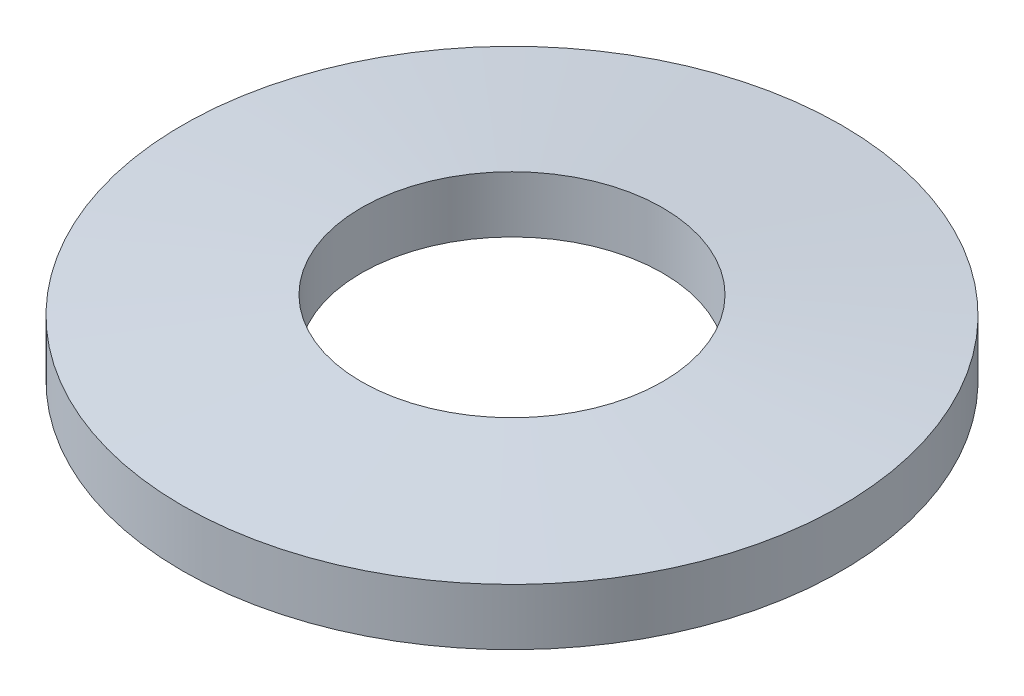
ISO-10303-21;
HEADER;
FILE_DESCRIPTION(('STEP AP214'),'2;1');
FILE_NAME('part.step','',(''),(''),'','','');
FILE_SCHEMA(('AUTOMOTIVE_DESIGN { 1 0 10303 214 1 1 1 1 }'));
ENDSEC;
DATA;
#1=APPLICATION_CONTEXT('core data for automotive mechanical design processes');
#2=APPLICATION_PROTOCOL_DEFINITION('international standard','automotive_design',2000,#1);
#3=PRODUCT_CONTEXT('',#1,'mechanical');
#4=PRODUCT('Part','Part','',(#3));
#5=PRODUCT_RELATED_PRODUCT_CATEGORY('part','',(#4));
#6=PRODUCT_DEFINITION_FORMATION('','',#4);
#7=PRODUCT_DEFINITION_CONTEXT('part definition',#1,'design');
#8=PRODUCT_DEFINITION('design','',#6,#7);
#9=PRODUCT_DEFINITION_SHAPE('','',#8);
#10=(LENGTH_UNIT() NAMED_UNIT(*) SI_UNIT(.MILLI.,.METRE.));
#11=(NAMED_UNIT(*) PLANE_ANGLE_UNIT() SI_UNIT($,.RADIAN.));
#12=(NAMED_UNIT(*) SI_UNIT($,.STERADIAN.) SOLID_ANGLE_UNIT());
#13=UNCERTAINTY_MEASURE_WITH_UNIT(LENGTH_MEASURE(1.E-05),#10,'distance_accuracy_value','');
#14=(GEOMETRIC_REPRESENTATION_CONTEXT(3) GLOBAL_UNCERTAINTY_ASSIGNED_CONTEXT((#13)) GLOBAL_UNIT_ASSIGNED_CONTEXT((#10,
#11,#12)) REPRESENTATION_CONTEXT('',''));
#15=CARTESIAN_POINT('',(0.,0.,0.));
#16=DIRECTION('',(0.,0.,1.));
#17=DIRECTION('',(1.,0.,0.));
#18=AXIS2_PLACEMENT_3D('',#15,#16,#17);
#19=CARTESIAN_POINT('',(0.,0.6,0.));
#20=DIRECTION('',(0.,-1.,0.));
#21=DIRECTION('',(0.,0.,-1.));
#22=AXIS2_PLACEMENT_3D('',#19,#20,#21);
#23=CONICAL_SURFACE('',#22,3.5,1.47112767430373);
#24=CARTESIAN_POINT('',(0.,0.789999999999999,0.));
#25=DIRECTION('',(0.,-1.,0.));
#26=DIRECTION('',(0.,0.,-1.));
#27=AXIS2_PLACEMENT_3D('',#24,#25,#26);
#28=CIRCLE('',#27,1.6);
#29=CARTESIAN_POINT('',(0.,0.789999999999999,-1.6));
#30=VERTEX_POINT('',#29);
#31=EDGE_CURVE('E10',#30,#30,#28,.T.);
#32=ORIENTED_EDGE('',*,*,#31,.T.);
#33=EDGE_LOOP('',(#32));
#34=FACE_BOUND('',#33,.T.);
#35=CARTESIAN_POINT('',(0.,0.6,0.));
#36=DIRECTION('',(0.,-1.,0.));
#37=DIRECTION('',(0.,0.,-1.));
#38=AXIS2_PLACEMENT_3D('',#35,#36,#37);
#39=CIRCLE('',#38,3.5);
#40=CARTESIAN_POINT('',(0.,0.6,-3.5));
#41=VERTEX_POINT('',#40);
#42=EDGE_CURVE('E47',#41,#41,#39,.T.);
#43=ORIENTED_EDGE('',*,*,#42,.F.);
#44=EDGE_LOOP('',(#43));
#45=FACE_BOUND('',#44,.T.);
#46=ADVANCED_FACE('F33',(#34,#45),#23,.T.);
#47=CARTESIAN_POINT('',(0.,0.,0.));
#48=DIRECTION('',(0.,-1.,0.));
#49=DIRECTION('',(0.,0.,-1.));
#50=AXIS2_PLACEMENT_3D('',#47,#48,#49);
#51=CYLINDRICAL_SURFACE('',#50,1.6);
#52=CARTESIAN_POINT('',(0.,0.19,0.));
#53=DIRECTION('',(0.,-1.,0.));
#54=DIRECTION('',(0.,0.,-1.));
#55=AXIS2_PLACEMENT_3D('',#52,#53,#54);
#56=CIRCLE('',#55,1.6);
#57=CARTESIAN_POINT('',(0.,0.19,-1.6));
#58=VERTEX_POINT('',#57);
#59=EDGE_CURVE('E39',#58,#58,#56,.T.);
#60=ORIENTED_EDGE('',*,*,#59,.T.);
#61=EDGE_LOOP('',(#60));
#62=FACE_BOUND('',#61,.T.);
#63=ORIENTED_EDGE('',*,*,#31,.F.);
#64=EDGE_LOOP('',(#63));
#65=FACE_BOUND('',#64,.T.);
#66=ADVANCED_FACE('F57',(#62,#65),#51,.F.);
#67=CARTESIAN_POINT('',(0.,0.19,0.));
#68=DIRECTION('',(0.,-1.,0.));
#69=DIRECTION('',(0.,0.,-1.));
#70=AXIS2_PLACEMENT_3D('',#67,#68,#69);
#71=CONICAL_SURFACE('',#70,1.6,1.47112767430373);
#72=CARTESIAN_POINT('',(0.,0.,0.));
#73=DIRECTION('',(0.,-1.,0.));
#74=DIRECTION('',(0.,0.,-1.));
#75=AXIS2_PLACEMENT_3D('',#72,#73,#74);
#76=CIRCLE('',#75,3.5);
#77=CARTESIAN_POINT('',(0.,0.,-3.5));
#78=VERTEX_POINT('',#77);
#79=EDGE_CURVE('E43',#78,#78,#76,.T.);
#80=ORIENTED_EDGE('',*,*,#79,.T.);
#81=EDGE_LOOP('',(#80));
#82=FACE_BOUND('',#81,.T.);
#83=ORIENTED_EDGE('',*,*,#59,.F.);
#84=EDGE_LOOP('',(#83));
#85=FACE_BOUND('',#84,.T.);
#86=ADVANCED_FACE('F61',(#82,#85),#71,.F.);
#87=CARTESIAN_POINT('',(0.,0.,0.));
#88=DIRECTION('',(0.,-1.,0.));
#89=DIRECTION('',(0.,0.,-1.));
#90=AXIS2_PLACEMENT_3D('',#87,#88,#89);
#91=CYLINDRICAL_SURFACE('',#90,3.5);
#92=ORIENTED_EDGE('',*,*,#42,.T.);
#93=EDGE_LOOP('',(#92));
#94=FACE_BOUND('',#93,.T.);
#95=ORIENTED_EDGE('',*,*,#79,.F.);
#96=EDGE_LOOP('',(#95));
#97=FACE_BOUND('',#96,.T.);
#98=ADVANCED_FACE('F53',(#94,#97),#91,.T.);
#99=CLOSED_SHELL('',(#46,#66,#86,#98));
#100=MANIFOLD_SOLID_BREP('B2',#99);
#101=ADVANCED_BREP_SHAPE_REPRESENTATION('',(#18,#100),#14);
#102=SHAPE_DEFINITION_REPRESENTATION(#9,#101);
ENDSEC;
END-ISO-10303-21;
